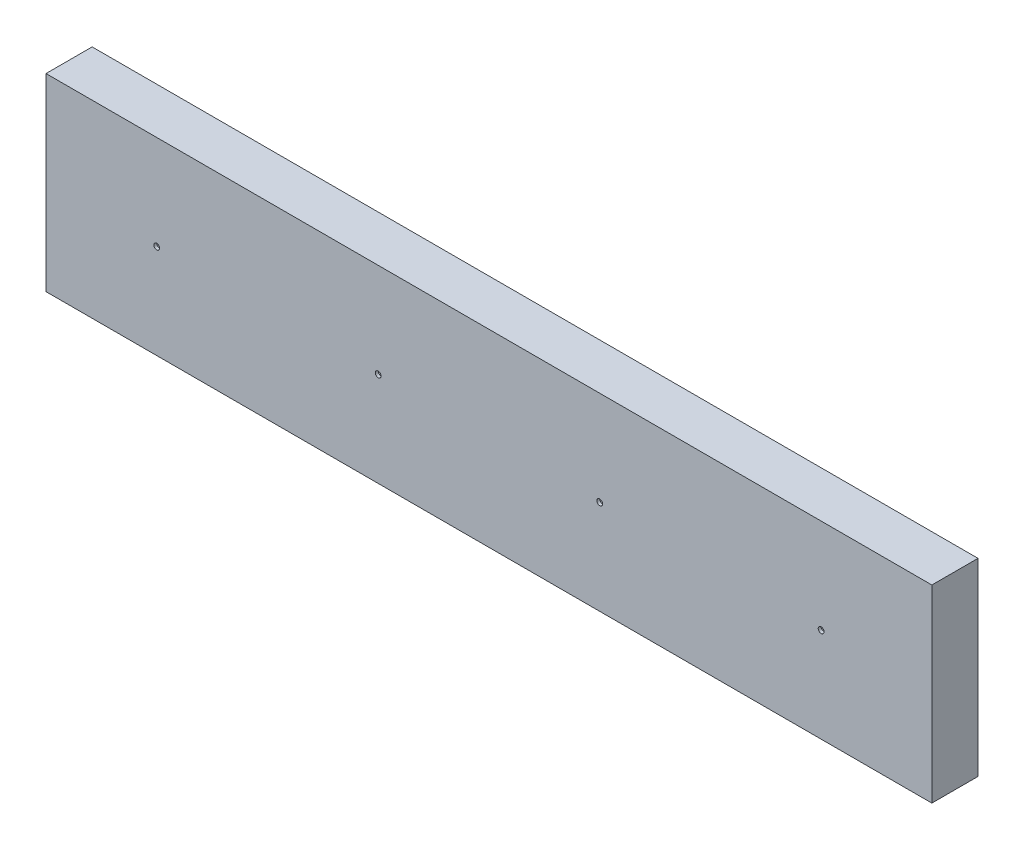
ISO-10303-21;
HEADER;
FILE_DESCRIPTION(('STEP AP214'),'2;1');
FILE_NAME('part.step','',(''),(''),'','','');
FILE_SCHEMA(('AUTOMOTIVE_DESIGN { 1 0 10303 214 1 1 1 1 }'));
ENDSEC;
DATA;
#1=APPLICATION_CONTEXT('core data for automotive mechanical design processes');
#2=APPLICATION_PROTOCOL_DEFINITION('international standard','automotive_design',2000,#1);
#3=PRODUCT_CONTEXT('',#1,'mechanical');
#4=PRODUCT('Part','Part','',(#3));
#5=PRODUCT_RELATED_PRODUCT_CATEGORY('part','',(#4));
#6=PRODUCT_DEFINITION_FORMATION('','',#4);
#7=PRODUCT_DEFINITION_CONTEXT('part definition',#1,'design');
#8=PRODUCT_DEFINITION('design','',#6,#7);
#9=PRODUCT_DEFINITION_SHAPE('','',#8);
#10=(LENGTH_UNIT() NAMED_UNIT(*) SI_UNIT(.MILLI.,.METRE.));
#11=(NAMED_UNIT(*) PLANE_ANGLE_UNIT() SI_UNIT($,.RADIAN.));
#12=(NAMED_UNIT(*) SI_UNIT($,.STERADIAN.) SOLID_ANGLE_UNIT());
#13=UNCERTAINTY_MEASURE_WITH_UNIT(LENGTH_MEASURE(1.E-05),#10,'distance_accuracy_value','');
#14=(GEOMETRIC_REPRESENTATION_CONTEXT(3) GLOBAL_UNCERTAINTY_ASSIGNED_CONTEXT((#13)) GLOBAL_UNIT_ASSIGNED_CONTEXT((#10,
#11,#12)) REPRESENTATION_CONTEXT('',''));
#15=CARTESIAN_POINT('',(0.,0.,0.));
#16=DIRECTION('',(0.,0.,1.));
#17=DIRECTION('',(1.,0.,0.));
#18=AXIS2_PLACEMENT_3D('',#15,#16,#17);
#19=CARTESIAN_POINT('',(152.4,32.5,15.875));
#20=DIRECTION('',(-1.,0.,0.));
#21=DIRECTION('',(0.,-1.,0.));
#22=AXIS2_PLACEMENT_3D('',#19,#20,#21);
#23=PLANE('',#22);
#24=DIRECTION('',(0.,1.,0.));
#25=VECTOR('',#24,1.);
#26=CARTESIAN_POINT('',(152.4,32.5,0.));
#27=LINE('',#26,#25);
#28=CARTESIAN_POINT('',(152.4,-32.5,0.));
#29=VERTEX_POINT('',#28);
#30=CARTESIAN_POINT('',(152.4,32.5,0.));
#31=VERTEX_POINT('',#30);
#32=EDGE_CURVE('E98',#29,#31,#27,.T.);
#33=ORIENTED_EDGE('',*,*,#32,.T.);
#34=DIRECTION('',(0.,0.,-1.));
#35=VECTOR('',#34,1.);
#36=CARTESIAN_POINT('',(152.4,32.5,15.875));
#37=LINE('',#36,#35);
#38=CARTESIAN_POINT('',(152.4,32.5,15.875));
#39=VERTEX_POINT('',#38);
#40=EDGE_CURVE('E11',#39,#31,#37,.T.);
#41=ORIENTED_EDGE('',*,*,#40,.F.);
#42=DIRECTION('',(0.,1.,0.));
#43=VECTOR('',#42,1.);
#44=CARTESIAN_POINT('',(152.4,32.5,15.875));
#45=LINE('',#44,#43);
#46=CARTESIAN_POINT('',(152.4,-32.5,15.875));
#47=VERTEX_POINT('',#46);
#48=EDGE_CURVE('E85',#47,#39,#45,.T.);
#49=ORIENTED_EDGE('',*,*,#48,.F.);
#50=DIRECTION('',(0.,0.,-1.));
#51=VECTOR('',#50,1.);
#52=CARTESIAN_POINT('',(152.4,-32.5,15.875));
#53=LINE('',#52,#51);
#54=EDGE_CURVE('E94',#47,#29,#53,.T.);
#55=ORIENTED_EDGE('',*,*,#54,.T.);
#56=EDGE_LOOP('',(#33,#41,#49,#55));
#57=FACE_BOUND('',#56,.T.);
#58=ADVANCED_FACE('F32',(#57),#23,.F.);
#59=CARTESIAN_POINT('',(-152.4,32.5,15.875));
#60=DIRECTION('',(0.,-1.,0.));
#61=DIRECTION('',(0.,0.,-1.));
#62=AXIS2_PLACEMENT_3D('',#59,#60,#61);
#63=PLANE('',#62);
#64=DIRECTION('',(-1.,0.,0.));
#65=VECTOR('',#64,1.);
#66=CARTESIAN_POINT('',(-152.4,32.5,0.));
#67=LINE('',#66,#65);
#68=CARTESIAN_POINT('',(-152.4,32.5,0.));
#69=VERTEX_POINT('',#68);
#70=EDGE_CURVE('E89',#31,#69,#67,.T.);
#71=ORIENTED_EDGE('',*,*,#70,.T.);
#72=DIRECTION('',(0.,0.,-1.));
#73=VECTOR('',#72,1.);
#74=CARTESIAN_POINT('',(-152.4,32.5,15.875));
#75=LINE('',#74,#73);
#76=CARTESIAN_POINT('',(-152.4,32.5,15.875));
#77=VERTEX_POINT('',#76);
#78=EDGE_CURVE('E41',#77,#69,#75,.T.);
#79=ORIENTED_EDGE('',*,*,#78,.F.);
#80=DIRECTION('',(-1.,0.,0.));
#81=VECTOR('',#80,1.);
#82=CARTESIAN_POINT('',(-152.4,32.5,15.875));
#83=LINE('',#82,#81);
#84=EDGE_CURVE('E80',#39,#77,#83,.T.);
#85=ORIENTED_EDGE('',*,*,#84,.F.);
#86=ORIENTED_EDGE('',*,*,#40,.T.);
#87=EDGE_LOOP('',(#71,#79,#85,#86));
#88=FACE_BOUND('',#87,.T.);
#89=ADVANCED_FACE('F88',(#88),#63,.F.);
#90=CARTESIAN_POINT('',(-152.4,32.5,15.875));
#91=DIRECTION('',(1.,0.,0.));
#92=DIRECTION('',(0.,1.,0.));
#93=AXIS2_PLACEMENT_3D('',#90,#91,#92);
#94=PLANE('',#93);
#95=DIRECTION('',(0.,-1.,0.));
#96=VECTOR('',#95,1.);
#97=CARTESIAN_POINT('',(-152.4,32.5,0.));
#98=LINE('',#97,#96);
#99=CARTESIAN_POINT('',(-152.4,-32.5,0.));
#100=VERTEX_POINT('',#99);
#101=EDGE_CURVE('E67',#69,#100,#98,.T.);
#102=ORIENTED_EDGE('',*,*,#101,.T.);
#103=DIRECTION('',(0.,0.,-1.));
#104=VECTOR('',#103,1.);
#105=CARTESIAN_POINT('',(-152.4,-32.5,15.875));
#106=LINE('',#105,#104);
#107=CARTESIAN_POINT('',(-152.4,-32.5,15.875));
#108=VERTEX_POINT('',#107);
#109=EDGE_CURVE('E90',#108,#100,#106,.T.);
#110=ORIENTED_EDGE('',*,*,#109,.F.);
#111=DIRECTION('',(0.,-1.,0.));
#112=VECTOR('',#111,1.);
#113=CARTESIAN_POINT('',(-152.4,32.5,15.875));
#114=LINE('',#113,#112);
#115=EDGE_CURVE('E83',#77,#108,#114,.T.);
#116=ORIENTED_EDGE('',*,*,#115,.F.);
#117=ORIENTED_EDGE('',*,*,#78,.T.);
#118=EDGE_LOOP('',(#102,#110,#116,#117));
#119=FACE_BOUND('',#118,.T.);
#120=ADVANCED_FACE('F92',(#119),#94,.F.);
#121=CARTESIAN_POINT('',(-152.4,-32.5,15.875));
#122=DIRECTION('',(0.,1.,0.));
#123=DIRECTION('',(0.,0.,1.));
#124=AXIS2_PLACEMENT_3D('',#121,#122,#123);
#125=PLANE('',#124);
#126=DIRECTION('',(1.,0.,0.));
#127=VECTOR('',#126,1.);
#128=CARTESIAN_POINT('',(-152.4,-32.5,0.));
#129=LINE('',#128,#127);
#130=EDGE_CURVE('E73',#100,#29,#129,.T.);
#131=ORIENTED_EDGE('',*,*,#130,.T.);
#132=ORIENTED_EDGE('',*,*,#54,.F.);
#133=DIRECTION('',(1.,0.,0.));
#134=VECTOR('',#133,1.);
#135=CARTESIAN_POINT('',(-152.4,-32.5,15.875));
#136=LINE('',#135,#134);
#137=EDGE_CURVE('E50',#108,#47,#136,.T.);
#138=ORIENTED_EDGE('',*,*,#137,.F.);
#139=ORIENTED_EDGE('',*,*,#109,.T.);
#140=EDGE_LOOP('',(#131,#132,#138,#139));
#141=FACE_BOUND('',#140,.T.);
#142=ADVANCED_FACE('F175',(#141),#125,.F.);
#143=CARTESIAN_POINT('',(0.,0.,15.875));
#144=DIRECTION('',(0.,0.,1.));
#145=DIRECTION('',(1.,0.,0.));
#146=AXIS2_PLACEMENT_3D('',#143,#144,#145);
#147=PLANE('',#146);
#148=CARTESIAN_POINT('',(-114.3,0.,15.875));
#149=DIRECTION('',(0.,0.,1.));
#150=DIRECTION('',(1.,0.,0.));
#151=AXIS2_PLACEMENT_3D('',#148,#149,#150);
#152=CIRCLE('',#151,0.999999999999998);
#153=CARTESIAN_POINT('',(-113.3,0.,15.875));
#154=VERTEX_POINT('',#153);
#155=EDGE_CURVE('E35',#154,#154,#152,.F.);
#156=ORIENTED_EDGE('',*,*,#155,.T.);
#157=EDGE_LOOP('',(#156));
#158=FACE_BOUND('',#157,.T.);
#159=CARTESIAN_POINT('',(114.3,0.,15.875));
#160=DIRECTION('',(0.,0.,1.));
#161=DIRECTION('',(1.,0.,0.));
#162=AXIS2_PLACEMENT_3D('',#159,#160,#161);
#163=CIRCLE('',#162,0.999999999999998);
#164=CARTESIAN_POINT('',(115.3,0.,15.875));
#165=VERTEX_POINT('',#164);
#166=EDGE_CURVE('E112',#165,#165,#163,.F.);
#167=ORIENTED_EDGE('',*,*,#166,.T.);
#168=EDGE_LOOP('',(#167));
#169=FACE_BOUND('',#168,.T.);
#170=CARTESIAN_POINT('',(38.1,0.,15.875));
#171=DIRECTION('',(0.,0.,1.));
#172=DIRECTION('',(1.,0.,0.));
#173=AXIS2_PLACEMENT_3D('',#170,#171,#172);
#174=CIRCLE('',#173,0.999999999999998);
#175=CARTESIAN_POINT('',(39.1,0.,15.875));
#176=VERTEX_POINT('',#175);
#177=EDGE_CURVE('E109',#176,#176,#174,.F.);
#178=ORIENTED_EDGE('',*,*,#177,.T.);
#179=EDGE_LOOP('',(#178));
#180=FACE_BOUND('',#179,.T.);
#181=CARTESIAN_POINT('',(-38.1,0.,15.875));
#182=DIRECTION('',(0.,0.,1.));
#183=DIRECTION('',(1.,0.,0.));
#184=AXIS2_PLACEMENT_3D('',#181,#182,#183);
#185=CIRCLE('',#184,0.999999999999998);
#186=CARTESIAN_POINT('',(-37.1,0.,15.875));
#187=VERTEX_POINT('',#186);
#188=EDGE_CURVE('E106',#187,#187,#185,.F.);
#189=ORIENTED_EDGE('',*,*,#188,.T.);
#190=EDGE_LOOP('',(#189));
#191=FACE_BOUND('',#190,.T.);
#192=ORIENTED_EDGE('',*,*,#48,.T.);
#193=ORIENTED_EDGE('',*,*,#84,.T.);
#194=ORIENTED_EDGE('',*,*,#115,.T.);
#195=ORIENTED_EDGE('',*,*,#137,.T.);
#196=EDGE_LOOP('',(#192,#193,#194,#195));
#197=FACE_BOUND('',#196,.T.);
#198=ADVANCED_FACE('F81',(#158,#169,#180,#191,#197),#147,.T.);
#199=CARTESIAN_POINT('',(0.,0.,0.));
#200=DIRECTION('',(0.,0.,1.));
#201=DIRECTION('',(1.,0.,0.));
#202=AXIS2_PLACEMENT_3D('',#199,#200,#201);
#203=PLANE('',#202);
#204=ORIENTED_EDGE('',*,*,#32,.F.);
#205=ORIENTED_EDGE('',*,*,#130,.F.);
#206=ORIENTED_EDGE('',*,*,#101,.F.);
#207=ORIENTED_EDGE('',*,*,#70,.F.);
#208=EDGE_LOOP('',(#204,#205,#206,#207));
#209=FACE_BOUND('',#208,.T.);
#210=ADVANCED_FACE('F166',(#209),#203,.F.);
#211=CARTESIAN_POINT('',(-38.1,0.,15.875012));
#212=DIRECTION('',(0.,0.,-1.));
#213=DIRECTION('',(-1.,0.,0.));
#214=AXIS2_PLACEMENT_3D('',#211,#212,#213);
#215=CYLINDRICAL_SURFACE('',#214,0.999999999999998);
#216=ORIENTED_EDGE('',*,*,#188,.F.);
#217=EDGE_LOOP('',(#216));
#218=FACE_BOUND('',#217,.T.);
#219=CARTESIAN_POINT('',(-38.1,0.,14.875));
#220=DIRECTION('',(0.,0.,1.));
#221=DIRECTION('',(1.,0.,0.));
#222=AXIS2_PLACEMENT_3D('',#219,#220,#221);
#223=CIRCLE('',#222,0.999999999999998);
#224=CARTESIAN_POINT('',(-37.1,0.,14.875));
#225=VERTEX_POINT('',#224);
#226=EDGE_CURVE('E110',#225,#225,#223,.T.);
#227=ORIENTED_EDGE('',*,*,#226,.F.);
#228=EDGE_LOOP('',(#227));
#229=FACE_BOUND('',#228,.T.);
#230=ADVANCED_FACE('F154',(#218,#229),#215,.F.);
#231=CARTESIAN_POINT('',(-38.1,0.,14.875));
#232=DIRECTION('',(0.,0.,1.));
#233=DIRECTION('',(1.,0.,0.));
#234=AXIS2_PLACEMENT_3D('',#231,#232,#233);
#235=PLANE('',#234);
#236=ORIENTED_EDGE('',*,*,#226,.T.);
#237=EDGE_LOOP('',(#236));
#238=FACE_BOUND('',#237,.T.);
#239=ADVANCED_FACE('F145',(#238),#235,.T.);
#240=CARTESIAN_POINT('',(38.1,0.,15.875012));
#241=DIRECTION('',(0.,0.,-1.));
#242=DIRECTION('',(-1.,0.,0.));
#243=AXIS2_PLACEMENT_3D('',#240,#241,#242);
#244=CYLINDRICAL_SURFACE('',#243,0.999999999999998);
#245=ORIENTED_EDGE('',*,*,#177,.F.);
#246=EDGE_LOOP('',(#245));
#247=FACE_BOUND('',#246,.T.);
#248=CARTESIAN_POINT('',(38.1,0.,14.875));
#249=DIRECTION('',(0.,0.,1.));
#250=DIRECTION('',(1.,0.,0.));
#251=AXIS2_PLACEMENT_3D('',#248,#249,#250);
#252=CIRCLE('',#251,0.999999999999998);
#253=CARTESIAN_POINT('',(39.1,0.,14.875));
#254=VERTEX_POINT('',#253);
#255=EDGE_CURVE('E135',#254,#254,#252,.T.);
#256=ORIENTED_EDGE('',*,*,#255,.F.);
#257=EDGE_LOOP('',(#256));
#258=FACE_BOUND('',#257,.T.);
#259=ADVANCED_FACE('F143',(#247,#258),#244,.F.);
#260=CARTESIAN_POINT('',(38.1,0.,14.875));
#261=DIRECTION('',(0.,0.,1.));
#262=DIRECTION('',(1.,0.,0.));
#263=AXIS2_PLACEMENT_3D('',#260,#261,#262);
#264=PLANE('',#263);
#265=ORIENTED_EDGE('',*,*,#255,.T.);
#266=EDGE_LOOP('',(#265));
#267=FACE_BOUND('',#266,.T.);
#268=ADVANCED_FACE('F141',(#267),#264,.T.);
#269=CARTESIAN_POINT('',(114.3,0.,15.875012));
#270=DIRECTION('',(0.,0.,-1.));
#271=DIRECTION('',(-1.,0.,0.));
#272=AXIS2_PLACEMENT_3D('',#269,#270,#271);
#273=CYLINDRICAL_SURFACE('',#272,0.999999999999998);
#274=ORIENTED_EDGE('',*,*,#166,.F.);
#275=EDGE_LOOP('',(#274));
#276=FACE_BOUND('',#275,.T.);
#277=CARTESIAN_POINT('',(114.3,0.,14.875));
#278=DIRECTION('',(0.,0.,1.));
#279=DIRECTION('',(1.,0.,0.));
#280=AXIS2_PLACEMENT_3D('',#277,#278,#279);
#281=CIRCLE('',#280,0.999999999999998);
#282=CARTESIAN_POINT('',(115.3,0.,14.875));
#283=VERTEX_POINT('',#282);
#284=EDGE_CURVE('E130',#283,#283,#281,.T.);
#285=ORIENTED_EDGE('',*,*,#284,.F.);
#286=EDGE_LOOP('',(#285));
#287=FACE_BOUND('',#286,.T.);
#288=ADVANCED_FACE('F152',(#276,#287),#273,.F.);
#289=CARTESIAN_POINT('',(114.3,0.,14.875));
#290=DIRECTION('',(0.,0.,1.));
#291=DIRECTION('',(1.,0.,0.));
#292=AXIS2_PLACEMENT_3D('',#289,#290,#291);
#293=PLANE('',#292);
#294=ORIENTED_EDGE('',*,*,#284,.T.);
#295=EDGE_LOOP('',(#294));
#296=FACE_BOUND('',#295,.T.);
#297=ADVANCED_FACE('F124',(#296),#293,.T.);
#298=CARTESIAN_POINT('',(-114.3,0.,15.875012));
#299=DIRECTION('',(0.,0.,-1.));
#300=DIRECTION('',(-1.,0.,0.));
#301=AXIS2_PLACEMENT_3D('',#298,#299,#300);
#302=CYLINDRICAL_SURFACE('',#301,0.999999999999998);
#303=ORIENTED_EDGE('',*,*,#155,.F.);
#304=EDGE_LOOP('',(#303));
#305=FACE_BOUND('',#304,.T.);
#306=CARTESIAN_POINT('',(-114.3,0.,14.875));
#307=DIRECTION('',(0.,0.,1.));
#308=DIRECTION('',(1.,0.,0.));
#309=AXIS2_PLACEMENT_3D('',#306,#307,#308);
#310=CIRCLE('',#309,0.999999999999998);
#311=CARTESIAN_POINT('',(-113.3,0.,14.875));
#312=VERTEX_POINT('',#311);
#313=EDGE_CURVE('E128',#312,#312,#310,.T.);
#314=ORIENTED_EDGE('',*,*,#313,.F.);
#315=EDGE_LOOP('',(#314));
#316=FACE_BOUND('',#315,.T.);
#317=ADVANCED_FACE('F120',(#305,#316),#302,.F.);
#318=CARTESIAN_POINT('',(-114.3,0.,14.875));
#319=DIRECTION('',(0.,0.,1.));
#320=DIRECTION('',(1.,0.,0.));
#321=AXIS2_PLACEMENT_3D('',#318,#319,#320);
#322=PLANE('',#321);
#323=ORIENTED_EDGE('',*,*,#313,.T.);
#324=EDGE_LOOP('',(#323));
#325=FACE_BOUND('',#324,.T.);
#326=ADVANCED_FACE('F123',(#325),#322,.T.);
#327=CLOSED_SHELL('',(#58,#89,#120,#142,#198,#210,#230,#239,#259,#268,#288,#297,#317,#326));
#328=MANIFOLD_SOLID_BREP('B2',#327);
#329=ADVANCED_BREP_SHAPE_REPRESENTATION('',(#18,#328),#14);
#330=SHAPE_DEFINITION_REPRESENTATION(#9,#329);
ENDSEC;
END-ISO-10303-21;
